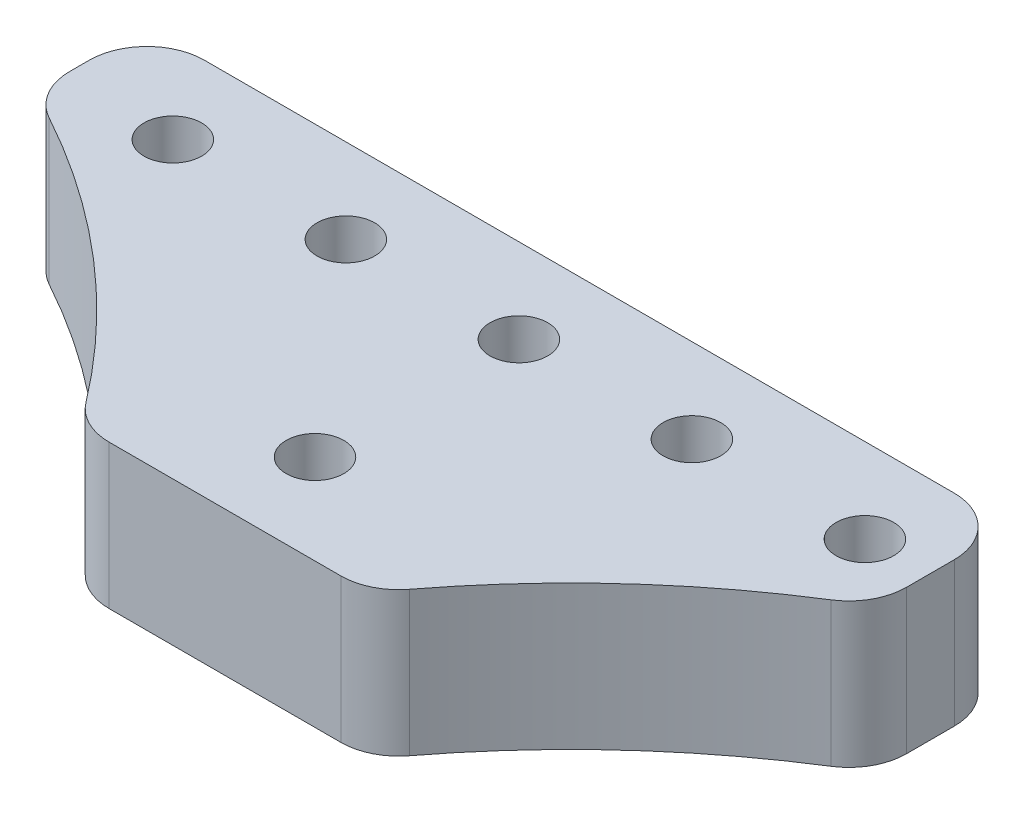
ISO-10303-21;
HEADER;
FILE_DESCRIPTION(('STEP AP214'),'2;1');
FILE_NAME('part.step','',(''),(''),'','','');
FILE_SCHEMA(('AUTOMOTIVE_DESIGN { 1 0 10303 214 1 1 1 1 }'));
ENDSEC;
DATA;
#1=APPLICATION_CONTEXT('core data for automotive mechanical design processes');
#2=APPLICATION_PROTOCOL_DEFINITION('international standard','automotive_design',2000,#1);
#3=PRODUCT_CONTEXT('',#1,'mechanical');
#4=PRODUCT('Part','Part','',(#3));
#5=PRODUCT_RELATED_PRODUCT_CATEGORY('part','',(#4));
#6=PRODUCT_DEFINITION_FORMATION('','',#4);
#7=PRODUCT_DEFINITION_CONTEXT('part definition',#1,'design');
#8=PRODUCT_DEFINITION('design','',#6,#7);
#9=PRODUCT_DEFINITION_SHAPE('','',#8);
#10=(LENGTH_UNIT() NAMED_UNIT(*) SI_UNIT(.MILLI.,.METRE.));
#11=(NAMED_UNIT(*) PLANE_ANGLE_UNIT() SI_UNIT($,.RADIAN.));
#12=(NAMED_UNIT(*) SI_UNIT($,.STERADIAN.) SOLID_ANGLE_UNIT());
#13=UNCERTAINTY_MEASURE_WITH_UNIT(LENGTH_MEASURE(1.E-05),#10,'distance_accuracy_value','');
#14=(GEOMETRIC_REPRESENTATION_CONTEXT(3) GLOBAL_UNCERTAINTY_ASSIGNED_CONTEXT((#13)) GLOBAL_UNIT_ASSIGNED_CONTEXT((#10,
#11,#12)) REPRESENTATION_CONTEXT('',''));
#15=CARTESIAN_POINT('',(0.,0.,0.));
#16=DIRECTION('',(0.,0.,1.));
#17=DIRECTION('',(1.,0.,0.));
#18=AXIS2_PLACEMENT_3D('',#15,#16,#17);
#19=CARTESIAN_POINT('',(0.,6.35,16.6652345173048));
#20=DIRECTION('',(0.,0.,-1.));
#21=DIRECTION('',(-1.,0.,0.));
#22=AXIS2_PLACEMENT_3D('',#19,#20,#21);
#23=PLANE('',#22);
#24=DIRECTION('',(1.,0.,0.));
#25=VECTOR('',#24,1.);
#26=CARTESIAN_POINT('',(0.,6.35,16.6652345173048));
#27=LINE('',#26,#25);
#28=CARTESIAN_POINT('',(15.0031682788959,6.35,16.6652345173048));
#29=VERTEX_POINT('',#28);
#30=CARTESIAN_POINT('',(25.2093042764426,6.35,16.6652345173048));
#31=VERTEX_POINT('',#30);
#32=EDGE_CURVE('E144',#29,#31,#27,.T.);
#33=ORIENTED_EDGE('',*,*,#32,.F.);
#34=DIRECTION('',(0.,1.,0.));
#35=VECTOR('',#34,1.);
#36=CARTESIAN_POINT('',(15.0031682788959,0.,16.6652345173048));
#37=LINE('',#36,#35);
#38=CARTESIAN_POINT('',(15.0031682788959,0.,16.6652345173048));
#39=VERTEX_POINT('',#38);
#40=EDGE_CURVE('E129',#29,#39,#37,.F.);
#41=ORIENTED_EDGE('',*,*,#40,.T.);
#42=DIRECTION('',(1.,0.,0.));
#43=VECTOR('',#42,1.);
#44=CARTESIAN_POINT('',(0.,0.,16.6652345173048));
#45=LINE('',#44,#43);
#46=CARTESIAN_POINT('',(25.2093042764426,0.,16.6652345173048));
#47=VERTEX_POINT('',#46);
#48=EDGE_CURVE('E141',#39,#47,#45,.T.);
#49=ORIENTED_EDGE('',*,*,#48,.T.);
#50=DIRECTION('',(0.,-1.,0.));
#51=VECTOR('',#50,1.);
#52=CARTESIAN_POINT('',(25.2093042764426,6.35,16.6652345173048));
#53=LINE('',#52,#51);
#54=EDGE_CURVE('E146',#47,#31,#53,.F.);
#55=ORIENTED_EDGE('',*,*,#54,.T.);
#56=EDGE_LOOP('',(#33,#41,#49,#55));
#57=FACE_BOUND('',#56,.T.);
#58=ADVANCED_FACE('F35',(#57),#23,.F.);
#59=CARTESIAN_POINT('',(56.6434499742083,6.35,38.0237975278566));
#60=DIRECTION('',(0.,-1.,0.));
#61=DIRECTION('',(0.,0.,-1.));
#62=AXIS2_PLACEMENT_3D('',#59,#60,#61);
#63=CYLINDRICAL_SURFACE('',#62,36.9472996002218);
#64=CARTESIAN_POINT('',(56.6434499742083,6.35,38.0237975278566));
#65=DIRECTION('',(0.,1.,0.));
#66=DIRECTION('',(0.,0.,1.));
#67=AXIS2_PLACEMENT_3D('',#64,#65,#66);
#68=CIRCLE('',#67,36.9472996002218);
#69=CARTESIAN_POINT('',(27.2312893420376,6.35,15.6624971476028));
#70=VERTEX_POINT('',#69);
#71=CARTESIAN_POINT('',(36.9161819490485,6.35,6.78379362241421));
#72=VERTEX_POINT('',#71);
#73=EDGE_CURVE('E337',#70,#72,#68,.F.);
#74=ORIENTED_EDGE('',*,*,#73,.F.);
#75=DIRECTION('',(0.,-1.,0.));
#76=VECTOR('',#75,1.);
#77=CARTESIAN_POINT('',(27.2312893420376,6.35,15.6624971476028));
#78=LINE('',#77,#76);
#79=CARTESIAN_POINT('',(27.2312893420376,0.,15.6624971476028));
#80=VERTEX_POINT('',#79);
#81=EDGE_CURVE('E212',#70,#80,#78,.T.);
#82=ORIENTED_EDGE('',*,*,#81,.T.);
#83=CARTESIAN_POINT('',(56.6434499742083,0.,38.0237975278566));
#84=DIRECTION('',(0.,1.,0.));
#85=DIRECTION('',(0.,0.,1.));
#86=AXIS2_PLACEMENT_3D('',#83,#84,#85);
#87=CIRCLE('',#86,36.9472996002218);
#88=CARTESIAN_POINT('',(36.9161819490485,0.,6.78379362241421));
#89=VERTEX_POINT('',#88);
#90=EDGE_CURVE('E151',#80,#89,#87,.F.);
#91=ORIENTED_EDGE('',*,*,#90,.T.);
#92=DIRECTION('',(0.,-1.,0.));
#93=VECTOR('',#92,1.);
#94=CARTESIAN_POINT('',(36.9161819490485,6.35,6.78379362241421));
#95=LINE('',#94,#93);
#96=EDGE_CURVE('E210',#89,#72,#95,.F.);
#97=ORIENTED_EDGE('',*,*,#96,.T.);
#98=EDGE_LOOP('',(#74,#82,#91,#97));
#99=FACE_BOUND('',#98,.T.);
#100=ADVANCED_FACE('F283',(#99),#63,.F.);
#101=CARTESIAN_POINT('',(38.1,6.35,0.));
#102=DIRECTION('',(1.,0.,0.));
#103=DIRECTION('',(0.,0.,-1.));
#104=AXIS2_PLACEMENT_3D('',#101,#102,#103);
#105=PLANE('',#104);
#106=DIRECTION('',(0.,0.,1.));
#107=VECTOR('',#106,1.);
#108=CARTESIAN_POINT('',(38.1,6.35,0.));
#109=LINE('',#108,#107);
#110=CARTESIAN_POINT('',(38.1,6.35,2.54));
#111=VERTEX_POINT('',#110);
#112=CARTESIAN_POINT('',(38.1,6.35,4.63615060713556));
#113=VERTEX_POINT('',#112);
#114=EDGE_CURVE('E246',#111,#113,#109,.T.);
#115=ORIENTED_EDGE('',*,*,#114,.T.);
#116=DIRECTION('',(0.,1.,0.));
#117=VECTOR('',#116,1.);
#118=CARTESIAN_POINT('',(38.1,0.,4.63615060713556));
#119=LINE('',#118,#117);
#120=CARTESIAN_POINT('',(38.1,0.,4.63615060713556));
#121=VERTEX_POINT('',#120);
#122=EDGE_CURVE('E217',#113,#121,#119,.F.);
#123=ORIENTED_EDGE('',*,*,#122,.T.);
#124=DIRECTION('',(0.,0.,1.));
#125=VECTOR('',#124,1.);
#126=CARTESIAN_POINT('',(38.1,0.,0.));
#127=LINE('',#126,#125);
#128=CARTESIAN_POINT('',(38.1,0.,2.54));
#129=VERTEX_POINT('',#128);
#130=EDGE_CURVE('E154',#129,#121,#127,.T.);
#131=ORIENTED_EDGE('',*,*,#130,.F.);
#132=DIRECTION('',(0.,-1.,0.));
#133=VECTOR('',#132,1.);
#134=CARTESIAN_POINT('',(38.1,6.35,2.54));
#135=LINE('',#134,#133);
#136=EDGE_CURVE('E215',#129,#111,#135,.F.);
#137=ORIENTED_EDGE('',*,*,#136,.T.);
#138=EDGE_LOOP('',(#115,#123,#131,#137));
#139=FACE_BOUND('',#138,.T.);
#140=ADVANCED_FACE('F288',(#139),#105,.T.);
#141=CARTESIAN_POINT('',(0.,6.35,0.));
#142=DIRECTION('',(0.,0.,-1.));
#143=DIRECTION('',(-1.,0.,0.));
#144=AXIS2_PLACEMENT_3D('',#141,#142,#143);
#145=PLANE('',#144);
#146=DIRECTION('',(1.,0.,0.));
#147=VECTOR('',#146,1.);
#148=CARTESIAN_POINT('',(0.,6.35,0.));
#149=LINE('',#148,#147);
#150=CARTESIAN_POINT('',(2.54,6.35,0.));
#151=VERTEX_POINT('',#150);
#152=CARTESIAN_POINT('',(35.56,6.35,0.));
#153=VERTEX_POINT('',#152);
#154=EDGE_CURVE('E230',#151,#153,#149,.T.);
#155=ORIENTED_EDGE('',*,*,#154,.T.);
#156=DIRECTION('',(0.,-1.,0.));
#157=VECTOR('',#156,1.);
#158=CARTESIAN_POINT('',(35.56,6.35,0.));
#159=LINE('',#158,#157);
#160=CARTESIAN_POINT('',(35.56,0.,0.));
#161=VERTEX_POINT('',#160);
#162=EDGE_CURVE('E222',#153,#161,#159,.T.);
#163=ORIENTED_EDGE('',*,*,#162,.T.);
#164=DIRECTION('',(1.,0.,0.));
#165=VECTOR('',#164,1.);
#166=CARTESIAN_POINT('',(0.,0.,0.));
#167=LINE('',#166,#165);
#168=CARTESIAN_POINT('',(2.54,0.,0.));
#169=VERTEX_POINT('',#168);
#170=EDGE_CURVE('E162',#169,#161,#167,.T.);
#171=ORIENTED_EDGE('',*,*,#170,.F.);
#172=DIRECTION('',(0.,-1.,0.));
#173=VECTOR('',#172,1.);
#174=CARTESIAN_POINT('',(2.54,6.35,0.));
#175=LINE('',#174,#173);
#176=EDGE_CURVE('E220',#169,#151,#175,.F.);
#177=ORIENTED_EDGE('',*,*,#176,.T.);
#178=EDGE_LOOP('',(#155,#163,#171,#177));
#179=FACE_BOUND('',#178,.T.);
#180=ADVANCED_FACE('F228',(#179),#145,.T.);
#181=CARTESIAN_POINT('',(0.,6.35,0.));
#182=DIRECTION('',(1.,0.,0.));
#183=DIRECTION('',(0.,0.,-1.));
#184=AXIS2_PLACEMENT_3D('',#181,#182,#183);
#185=PLANE('',#184);
#186=DIRECTION('',(0.,0.,1.));
#187=VECTOR('',#186,1.);
#188=CARTESIAN_POINT('',(0.,6.35,0.));
#189=LINE('',#188,#187);
#190=CARTESIAN_POINT('',(0.,6.35,2.54));
#191=VERTEX_POINT('',#190);
#192=CARTESIAN_POINT('',(0.,6.35,3.39218125759846));
#193=VERTEX_POINT('',#192);
#194=EDGE_CURVE('E239',#191,#193,#189,.T.);
#195=ORIENTED_EDGE('',*,*,#194,.F.);
#196=DIRECTION('',(0.,-1.,0.));
#197=VECTOR('',#196,1.);
#198=CARTESIAN_POINT('',(0.,0.,2.54));
#199=LINE('',#198,#197);
#200=CARTESIAN_POINT('',(0.,0.,2.54));
#201=VERTEX_POINT('',#200);
#202=EDGE_CURVE('E11',#191,#201,#199,.T.);
#203=ORIENTED_EDGE('',*,*,#202,.T.);
#204=DIRECTION('',(0.,0.,1.));
#205=VECTOR('',#204,1.);
#206=CARTESIAN_POINT('',(0.,0.,0.));
#207=LINE('',#206,#205);
#208=CARTESIAN_POINT('',(0.,0.,3.39218125759846));
#209=VERTEX_POINT('',#208);
#210=EDGE_CURVE('E165',#201,#209,#207,.T.);
#211=ORIENTED_EDGE('',*,*,#210,.T.);
#212=DIRECTION('',(0.,1.,0.));
#213=VECTOR('',#212,1.);
#214=CARTESIAN_POINT('',(0.,6.35,3.39218125759846));
#215=LINE('',#214,#213);
#216=EDGE_CURVE('E43',#209,#193,#215,.T.);
#217=ORIENTED_EDGE('',*,*,#216,.T.);
#218=EDGE_LOOP('',(#195,#203,#211,#217));
#219=FACE_BOUND('',#218,.T.);
#220=ADVANCED_FACE('F238',(#219),#185,.F.);
#221=CARTESIAN_POINT('',(4.86623627766924,6.35,3.72093701956544));
#222=DIRECTION('',(0.,-1.,0.));
#223=DIRECTION('',(0.,0.,-1.));
#224=AXIS2_PLACEMENT_3D('',#221,#222,#223);
#225=CYLINDRICAL_SURFACE('',#224,1.27);
#226=CARTESIAN_POINT('',(4.86623627766924,6.35,3.72093701956544));
#227=DIRECTION('',(0.,1.,0.));
#228=DIRECTION('',(0.,0.,1.));
#229=AXIS2_PLACEMENT_3D('',#226,#227,#228);
#230=CIRCLE('',#229,1.27);
#231=CARTESIAN_POINT('',(4.86623627766924,6.35,4.99093701956544));
#232=VERTEX_POINT('',#231);
#233=EDGE_CURVE('E260',#232,#232,#230,.T.);
#234=ORIENTED_EDGE('',*,*,#233,.T.);
#235=EDGE_LOOP('',(#234));
#236=FACE_BOUND('',#235,.T.);
#237=CARTESIAN_POINT('',(4.86623627766924,0.,3.72093701956544));
#238=DIRECTION('',(0.,1.,0.));
#239=DIRECTION('',(0.,0.,1.));
#240=AXIS2_PLACEMENT_3D('',#237,#238,#239);
#241=CIRCLE('',#240,1.27);
#242=CARTESIAN_POINT('',(4.86623627766924,0.,4.99093701956544));
#243=VERTEX_POINT('',#242);
#244=EDGE_CURVE('E181',#243,#243,#241,.T.);
#245=ORIENTED_EDGE('',*,*,#244,.F.);
#246=EDGE_LOOP('',(#245));
#247=FACE_BOUND('',#246,.T.);
#248=ADVANCED_FACE('F327',(#236,#247),#225,.F.);
#249=CARTESIAN_POINT('',(12.4862362776692,6.35,3.72093701956544));
#250=DIRECTION('',(0.,-1.,0.));
#251=DIRECTION('',(0.,0.,-1.));
#252=AXIS2_PLACEMENT_3D('',#249,#250,#251);
#253=CYLINDRICAL_SURFACE('',#252,1.27);
#254=CARTESIAN_POINT('',(12.4862362776692,6.35,3.72093701956544));
#255=DIRECTION('',(0.,1.,0.));
#256=DIRECTION('',(0.,0.,1.));
#257=AXIS2_PLACEMENT_3D('',#254,#255,#256);
#258=CIRCLE('',#257,1.27);
#259=CARTESIAN_POINT('',(12.4862362776692,6.35,4.99093701956544));
#260=VERTEX_POINT('',#259);
#261=EDGE_CURVE('E258',#260,#260,#258,.T.);
#262=ORIENTED_EDGE('',*,*,#261,.T.);
#263=EDGE_LOOP('',(#262));
#264=FACE_BOUND('',#263,.T.);
#265=CARTESIAN_POINT('',(12.4862362776692,0.,3.72093701956544));
#266=DIRECTION('',(0.,1.,0.));
#267=DIRECTION('',(0.,0.,1.));
#268=AXIS2_PLACEMENT_3D('',#265,#266,#267);
#269=CIRCLE('',#268,1.27);
#270=CARTESIAN_POINT('',(12.4862362776692,0.,4.99093701956544));
#271=VERTEX_POINT('',#270);
#272=EDGE_CURVE('E178',#271,#271,#269,.T.);
#273=ORIENTED_EDGE('',*,*,#272,.F.);
#274=EDGE_LOOP('',(#273));
#275=FACE_BOUND('',#274,.T.);
#276=ADVANCED_FACE('F362',(#264,#275),#253,.F.);
#277=CARTESIAN_POINT('',(27.7262362776692,6.35,3.72093701956544));
#278=DIRECTION('',(0.,-1.,0.));
#279=DIRECTION('',(0.,0.,-1.));
#280=AXIS2_PLACEMENT_3D('',#277,#278,#279);
#281=CYLINDRICAL_SURFACE('',#280,1.27);
#282=CARTESIAN_POINT('',(27.7262362776692,6.35,3.72093701956544));
#283=DIRECTION('',(0.,1.,0.));
#284=DIRECTION('',(0.,0.,1.));
#285=AXIS2_PLACEMENT_3D('',#282,#283,#284);
#286=CIRCLE('',#285,1.27);
#287=CARTESIAN_POINT('',(27.7262362776692,6.35,4.99093701956544));
#288=VERTEX_POINT('',#287);
#289=EDGE_CURVE('E255',#288,#288,#286,.T.);
#290=ORIENTED_EDGE('',*,*,#289,.T.);
#291=EDGE_LOOP('',(#290));
#292=FACE_BOUND('',#291,.T.);
#293=CARTESIAN_POINT('',(27.7262362776692,0.,3.72093701956544));
#294=DIRECTION('',(0.,1.,0.));
#295=DIRECTION('',(0.,0.,1.));
#296=AXIS2_PLACEMENT_3D('',#293,#294,#295);
#297=CIRCLE('',#296,1.27);
#298=CARTESIAN_POINT('',(27.7262362776692,0.,4.99093701956544));
#299=VERTEX_POINT('',#298);
#300=EDGE_CURVE('E175',#299,#299,#297,.T.);
#301=ORIENTED_EDGE('',*,*,#300,.F.);
#302=EDGE_LOOP('',(#301));
#303=FACE_BOUND('',#302,.T.);
#304=ADVANCED_FACE('F369',(#292,#303),#281,.F.);
#305=CARTESIAN_POINT('',(35.3462362776692,6.35,3.72093701956544));
#306=DIRECTION('',(0.,-1.,0.));
#307=DIRECTION('',(0.,0.,-1.));
#308=AXIS2_PLACEMENT_3D('',#305,#306,#307);
#309=CYLINDRICAL_SURFACE('',#308,1.27000000000001);
#310=CARTESIAN_POINT('',(35.3462362776692,6.35,3.72093701956544));
#311=DIRECTION('',(0.,1.,0.));
#312=DIRECTION('',(0.,0.,1.));
#313=AXIS2_PLACEMENT_3D('',#310,#311,#312);
#314=CIRCLE('',#313,1.27000000000001);
#315=CARTESIAN_POINT('',(35.3462362776692,6.35,4.99093701956545));
#316=VERTEX_POINT('',#315);
#317=EDGE_CURVE('E252',#316,#316,#314,.T.);
#318=ORIENTED_EDGE('',*,*,#317,.T.);
#319=EDGE_LOOP('',(#318));
#320=FACE_BOUND('',#319,.T.);
#321=CARTESIAN_POINT('',(35.3462362776692,0.,3.72093701956544));
#322=DIRECTION('',(0.,1.,0.));
#323=DIRECTION('',(0.,0.,1.));
#324=AXIS2_PLACEMENT_3D('',#321,#322,#323);
#325=CIRCLE('',#324,1.27000000000001);
#326=CARTESIAN_POINT('',(35.3462362776692,0.,4.99093701956545));
#327=VERTEX_POINT('',#326);
#328=EDGE_CURVE('E172',#327,#327,#325,.T.);
#329=ORIENTED_EDGE('',*,*,#328,.F.);
#330=EDGE_LOOP('',(#329));
#331=FACE_BOUND('',#330,.T.);
#332=ADVANCED_FACE('F320',(#320,#331),#309,.F.);
#333=CARTESIAN_POINT('',(20.1062362776692,6.35,12.7));
#334=DIRECTION('',(0.,-1.,0.));
#335=DIRECTION('',(0.,0.,-1.));
#336=AXIS2_PLACEMENT_3D('',#333,#334,#335);
#337=CYLINDRICAL_SURFACE('',#336,1.27);
#338=CARTESIAN_POINT('',(20.1062362776692,6.35,12.7));
#339=DIRECTION('',(0.,1.,0.));
#340=DIRECTION('',(0.,0.,1.));
#341=AXIS2_PLACEMENT_3D('',#338,#339,#340);
#342=CIRCLE('',#341,1.27);
#343=CARTESIAN_POINT('',(20.1062362776692,6.35,13.97));
#344=VERTEX_POINT('',#343);
#345=EDGE_CURVE('E244',#344,#344,#342,.T.);
#346=ORIENTED_EDGE('',*,*,#345,.T.);
#347=EDGE_LOOP('',(#346));
#348=FACE_BOUND('',#347,.T.);
#349=CARTESIAN_POINT('',(20.1062362776692,0.,12.7));
#350=DIRECTION('',(0.,1.,0.));
#351=DIRECTION('',(0.,0.,1.));
#352=AXIS2_PLACEMENT_3D('',#349,#350,#351);
#353=CIRCLE('',#352,1.27);
#354=CARTESIAN_POINT('',(20.1062362776692,0.,13.97));
#355=VERTEX_POINT('',#354);
#356=EDGE_CURVE('E169',#355,#355,#353,.T.);
#357=ORIENTED_EDGE('',*,*,#356,.F.);
#358=EDGE_LOOP('',(#357));
#359=FACE_BOUND('',#358,.T.);
#360=ADVANCED_FACE('F315',(#348,#359),#337,.F.);
#361=CARTESIAN_POINT('',(-16.4309774188698,6.35,38.0237975278566));
#362=DIRECTION('',(0.,-1.,0.));
#363=DIRECTION('',(0.,0.,-1.));
#364=AXIS2_PLACEMENT_3D('',#361,#362,#363);
#365=CYLINDRICAL_SURFACE('',#364,36.9472996002218);
#366=CARTESIAN_POINT('',(-16.4309774188698,0.,38.0237975278566));
#367=DIRECTION('',(0.,1.,0.));
#368=DIRECTION('',(0.,0.,1.));
#369=AXIS2_PLACEMENT_3D('',#366,#367,#368);
#370=CIRCLE('',#369,36.9472996002218);
#371=CARTESIAN_POINT('',(12.9811832133009,0.,15.6624971476028));
#372=VERTEX_POINT('',#371);
#373=CARTESIAN_POINT('',(1.31970174887171,0.,5.61984195400023));
#374=VERTEX_POINT('',#373);
#375=EDGE_CURVE('E167',#372,#374,#370,.T.);
#376=ORIENTED_EDGE('',*,*,#375,.F.);
#377=DIRECTION('',(0.,-1.,0.));
#378=VECTOR('',#377,1.);
#379=CARTESIAN_POINT('',(12.9811832133009,6.35,15.6624971476028));
#380=LINE('',#379,#378);
#381=CARTESIAN_POINT('',(12.9811832133009,6.35,15.6624971476028));
#382=VERTEX_POINT('',#381);
#383=EDGE_CURVE('E130',#372,#382,#380,.F.);
#384=ORIENTED_EDGE('',*,*,#383,.T.);
#385=CARTESIAN_POINT('',(-16.4309774188698,6.35,38.0237975278566));
#386=DIRECTION('',(0.,1.,0.));
#387=DIRECTION('',(0.,0.,1.));
#388=AXIS2_PLACEMENT_3D('',#385,#386,#387);
#389=CIRCLE('',#388,36.9472996002218);
#390=CARTESIAN_POINT('',(1.31970174887171,6.35,5.61984195400023));
#391=VERTEX_POINT('',#390);
#392=EDGE_CURVE('E241',#382,#391,#389,.T.);
#393=ORIENTED_EDGE('',*,*,#392,.T.);
#394=DIRECTION('',(0.,-1.,0.));
#395=VECTOR('',#394,1.);
#396=CARTESIAN_POINT('',(1.31970174887171,6.35,5.61984195400023));
#397=LINE('',#396,#395);
#398=EDGE_CURVE('E135',#391,#374,#397,.T.);
#399=ORIENTED_EDGE('',*,*,#398,.T.);
#400=EDGE_LOOP('',(#376,#384,#393,#399));
#401=FACE_BOUND('',#400,.T.);
#402=ADVANCED_FACE('F278',(#401),#365,.F.);
#403=CARTESIAN_POINT('',(20.1062362776692,6.35,3.72093701956544));
#404=DIRECTION('',(0.,-1.,0.));
#405=DIRECTION('',(0.,0.,-1.));
#406=AXIS2_PLACEMENT_3D('',#403,#404,#405);
#407=CYLINDRICAL_SURFACE('',#406,1.27);
#408=CARTESIAN_POINT('',(20.1062362776692,6.35,3.72093701956544));
#409=DIRECTION('',(0.,1.,0.));
#410=DIRECTION('',(0.,0.,1.));
#411=AXIS2_PLACEMENT_3D('',#408,#409,#410);
#412=CIRCLE('',#411,1.27);
#413=CARTESIAN_POINT('',(20.1062362776692,6.35,4.99093701956544));
#414=VERTEX_POINT('',#413);
#415=EDGE_CURVE('E157',#414,#414,#412,.T.);
#416=ORIENTED_EDGE('',*,*,#415,.T.);
#417=EDGE_LOOP('',(#416));
#418=FACE_BOUND('',#417,.T.);
#419=CARTESIAN_POINT('',(20.1062362776692,0.,3.72093701956544));
#420=DIRECTION('',(0.,1.,0.));
#421=DIRECTION('',(0.,0.,1.));
#422=AXIS2_PLACEMENT_3D('',#419,#420,#421);
#423=CIRCLE('',#422,1.27);
#424=CARTESIAN_POINT('',(20.1062362776692,0.,4.99093701956544));
#425=VERTEX_POINT('',#424);
#426=EDGE_CURVE('E184',#425,#425,#423,.T.);
#427=ORIENTED_EDGE('',*,*,#426,.F.);
#428=EDGE_LOOP('',(#427));
#429=FACE_BOUND('',#428,.T.);
#430=ADVANCED_FACE('F267',(#418,#429),#407,.F.);
#431=CARTESIAN_POINT('',(0.,6.35,0.));
#432=DIRECTION('',(0.,1.,0.));
#433=DIRECTION('',(0.,0.,1.));
#434=AXIS2_PLACEMENT_3D('',#431,#432,#433);
#435=PLANE('',#434);
#436=ORIENTED_EDGE('',*,*,#392,.F.);
#437=CARTESIAN_POINT('',(15.0031682788959,6.35,14.1252345173048));
#438=DIRECTION('',(0.,1.,0.));
#439=DIRECTION('',(0.,0.,1.));
#440=AXIS2_PLACEMENT_3D('',#437,#438,#439);
#441=CIRCLE('',#440,2.54);
#442=EDGE_CURVE('E208',#382,#29,#441,.T.);
#443=ORIENTED_EDGE('',*,*,#442,.T.);
#444=ORIENTED_EDGE('',*,*,#32,.T.);
#445=CARTESIAN_POINT('',(25.2093042764426,6.35,14.1252345173048));
#446=DIRECTION('',(0.,1.,0.));
#447=DIRECTION('',(0.,0.,1.));
#448=AXIS2_PLACEMENT_3D('',#445,#446,#447);
#449=CIRCLE('',#448,2.54);
#450=EDGE_CURVE('E206',#31,#70,#449,.T.);
#451=ORIENTED_EDGE('',*,*,#450,.T.);
#452=ORIENTED_EDGE('',*,*,#73,.T.);
#453=CARTESIAN_POINT('',(35.56,6.35,4.63615060713556));
#454=DIRECTION('',(0.,1.,0.));
#455=DIRECTION('',(0.,0.,1.));
#456=AXIS2_PLACEMENT_3D('',#453,#454,#455);
#457=CIRCLE('',#456,2.54);
#458=EDGE_CURVE('E204',#72,#113,#457,.T.);
#459=ORIENTED_EDGE('',*,*,#458,.T.);
#460=ORIENTED_EDGE('',*,*,#114,.F.);
#461=CARTESIAN_POINT('',(35.56,6.35,2.54));
#462=DIRECTION('',(0.,1.,0.));
#463=DIRECTION('',(0.,0.,1.));
#464=AXIS2_PLACEMENT_3D('',#461,#462,#463);
#465=CIRCLE('',#464,2.54);
#466=EDGE_CURVE('E202',#111,#153,#465,.T.);
#467=ORIENTED_EDGE('',*,*,#466,.T.);
#468=ORIENTED_EDGE('',*,*,#154,.F.);
#469=CARTESIAN_POINT('',(2.54,6.35,2.54));
#470=DIRECTION('',(0.,1.,0.));
#471=DIRECTION('',(0.,0.,1.));
#472=AXIS2_PLACEMENT_3D('',#469,#470,#471);
#473=CIRCLE('',#472,2.54);
#474=EDGE_CURVE('E56',#151,#191,#473,.T.);
#475=ORIENTED_EDGE('',*,*,#474,.T.);
#476=ORIENTED_EDGE('',*,*,#194,.T.);
#477=CARTESIAN_POINT('',(2.54,6.35,3.39218125759846));
#478=DIRECTION('',(0.,1.,0.));
#479=DIRECTION('',(0.,0.,1.));
#480=AXIS2_PLACEMENT_3D('',#477,#478,#479);
#481=CIRCLE('',#480,2.54);
#482=EDGE_CURVE('E199',#193,#391,#481,.T.);
#483=ORIENTED_EDGE('',*,*,#482,.T.);
#484=EDGE_LOOP('',(#436,#443,#444,#451,#452,#459,#460,#467,#468,#475,#476,#483));
#485=FACE_BOUND('',#484,.T.);
#486=ORIENTED_EDGE('',*,*,#345,.F.);
#487=EDGE_LOOP('',(#486));
#488=FACE_BOUND('',#487,.T.);
#489=ORIENTED_EDGE('',*,*,#317,.F.);
#490=EDGE_LOOP('',(#489));
#491=FACE_BOUND('',#490,.T.);
#492=ORIENTED_EDGE('',*,*,#289,.F.);
#493=EDGE_LOOP('',(#492));
#494=FACE_BOUND('',#493,.T.);
#495=ORIENTED_EDGE('',*,*,#261,.F.);
#496=EDGE_LOOP('',(#495));
#497=FACE_BOUND('',#496,.T.);
#498=ORIENTED_EDGE('',*,*,#233,.F.);
#499=EDGE_LOOP('',(#498));
#500=FACE_BOUND('',#499,.T.);
#501=ORIENTED_EDGE('',*,*,#415,.F.);
#502=EDGE_LOOP('',(#501));
#503=FACE_BOUND('',#502,.T.);
#504=ADVANCED_FACE('F270',(#485,#488,#491,#494,#497,#500,#503),#435,.T.);
#505=CARTESIAN_POINT('',(0.,0.,0.));
#506=DIRECTION('',(0.,1.,0.));
#507=DIRECTION('',(0.,0.,1.));
#508=AXIS2_PLACEMENT_3D('',#505,#506,#507);
#509=PLANE('',#508);
#510=ORIENTED_EDGE('',*,*,#48,.F.);
#511=CARTESIAN_POINT('',(15.0031682788959,0.,14.1252345173048));
#512=DIRECTION('',(0.,1.,0.));
#513=DIRECTION('',(0.,0.,1.));
#514=AXIS2_PLACEMENT_3D('',#511,#512,#513);
#515=CIRCLE('',#514,2.54);
#516=EDGE_CURVE('E125',#39,#372,#515,.F.);
#517=ORIENTED_EDGE('',*,*,#516,.T.);
#518=ORIENTED_EDGE('',*,*,#375,.T.);
#519=CARTESIAN_POINT('',(2.54,0.,3.39218125759846));
#520=DIRECTION('',(0.,1.,0.));
#521=DIRECTION('',(0.,0.,1.));
#522=AXIS2_PLACEMENT_3D('',#519,#520,#521);
#523=CIRCLE('',#522,2.54);
#524=EDGE_CURVE('E145',#374,#209,#523,.F.);
#525=ORIENTED_EDGE('',*,*,#524,.T.);
#526=ORIENTED_EDGE('',*,*,#210,.F.);
#527=CARTESIAN_POINT('',(2.54,0.,2.54));
#528=DIRECTION('',(0.,1.,0.));
#529=DIRECTION('',(0.,0.,1.));
#530=AXIS2_PLACEMENT_3D('',#527,#528,#529);
#531=CIRCLE('',#530,2.54);
#532=EDGE_CURVE('E189',#201,#169,#531,.F.);
#533=ORIENTED_EDGE('',*,*,#532,.T.);
#534=ORIENTED_EDGE('',*,*,#170,.T.);
#535=CARTESIAN_POINT('',(35.56,0.,2.54));
#536=DIRECTION('',(0.,1.,0.));
#537=DIRECTION('',(0.,0.,1.));
#538=AXIS2_PLACEMENT_3D('',#535,#536,#537);
#539=CIRCLE('',#538,2.54);
#540=EDGE_CURVE('E191',#161,#129,#539,.F.);
#541=ORIENTED_EDGE('',*,*,#540,.T.);
#542=ORIENTED_EDGE('',*,*,#130,.T.);
#543=CARTESIAN_POINT('',(35.56,0.,4.63615060713556));
#544=DIRECTION('',(0.,1.,0.));
#545=DIRECTION('',(0.,0.,1.));
#546=AXIS2_PLACEMENT_3D('',#543,#544,#545);
#547=CIRCLE('',#546,2.54);
#548=EDGE_CURVE('E193',#121,#89,#547,.F.);
#549=ORIENTED_EDGE('',*,*,#548,.T.);
#550=ORIENTED_EDGE('',*,*,#90,.F.);
#551=CARTESIAN_POINT('',(25.2093042764426,0.,14.1252345173048));
#552=DIRECTION('',(0.,1.,0.));
#553=DIRECTION('',(0.,0.,1.));
#554=AXIS2_PLACEMENT_3D('',#551,#552,#553);
#555=CIRCLE('',#554,2.54);
#556=EDGE_CURVE('E136',#80,#47,#555,.F.);
#557=ORIENTED_EDGE('',*,*,#556,.T.);
#558=EDGE_LOOP('',(#510,#517,#518,#525,#526,#533,#534,#541,#542,#549,#550,#557));
#559=FACE_BOUND('',#558,.T.);
#560=ORIENTED_EDGE('',*,*,#356,.T.);
#561=EDGE_LOOP('',(#560));
#562=FACE_BOUND('',#561,.T.);
#563=ORIENTED_EDGE('',*,*,#328,.T.);
#564=EDGE_LOOP('',(#563));
#565=FACE_BOUND('',#564,.T.);
#566=ORIENTED_EDGE('',*,*,#300,.T.);
#567=EDGE_LOOP('',(#566));
#568=FACE_BOUND('',#567,.T.);
#569=ORIENTED_EDGE('',*,*,#272,.T.);
#570=EDGE_LOOP('',(#569));
#571=FACE_BOUND('',#570,.T.);
#572=ORIENTED_EDGE('',*,*,#244,.T.);
#573=EDGE_LOOP('',(#572));
#574=FACE_BOUND('',#573,.T.);
#575=ORIENTED_EDGE('',*,*,#426,.T.);
#576=EDGE_LOOP('',(#575));
#577=FACE_BOUND('',#576,.T.);
#578=ADVANCED_FACE('F148',(#559,#562,#565,#568,#571,#574,#577),#509,.F.);
#579=CARTESIAN_POINT('',(15.0031682788959,6.35,14.1252345173048));
#580=DIRECTION('',(0.,-1.,0.));
#581=DIRECTION('',(0.,0.,-1.));
#582=AXIS2_PLACEMENT_3D('',#579,#580,#581);
#583=CYLINDRICAL_SURFACE('',#582,2.54);
#584=ORIENTED_EDGE('',*,*,#442,.F.);
#585=ORIENTED_EDGE('',*,*,#383,.F.);
#586=ORIENTED_EDGE('',*,*,#516,.F.);
#587=ORIENTED_EDGE('',*,*,#40,.F.);
#588=EDGE_LOOP('',(#584,#585,#586,#587));
#589=FACE_BOUND('',#588,.T.);
#590=ADVANCED_FACE('F128',(#589),#583,.T.);
#591=CARTESIAN_POINT('',(25.2093042764426,6.35,14.1252345173048));
#592=DIRECTION('',(0.,-1.,0.));
#593=DIRECTION('',(0.,0.,-1.));
#594=AXIS2_PLACEMENT_3D('',#591,#592,#593);
#595=CYLINDRICAL_SURFACE('',#594,2.54);
#596=ORIENTED_EDGE('',*,*,#450,.F.);
#597=ORIENTED_EDGE('',*,*,#54,.F.);
#598=ORIENTED_EDGE('',*,*,#556,.F.);
#599=ORIENTED_EDGE('',*,*,#81,.F.);
#600=EDGE_LOOP('',(#596,#597,#598,#599));
#601=FACE_BOUND('',#600,.T.);
#602=ADVANCED_FACE('F295',(#601),#595,.T.);
#603=CARTESIAN_POINT('',(35.56,6.35,4.63615060713556));
#604=DIRECTION('',(0.,-1.,0.));
#605=DIRECTION('',(0.,0.,-1.));
#606=AXIS2_PLACEMENT_3D('',#603,#604,#605);
#607=CYLINDRICAL_SURFACE('',#606,2.54);
#608=ORIENTED_EDGE('',*,*,#458,.F.);
#609=ORIENTED_EDGE('',*,*,#96,.F.);
#610=ORIENTED_EDGE('',*,*,#548,.F.);
#611=ORIENTED_EDGE('',*,*,#122,.F.);
#612=EDGE_LOOP('',(#608,#609,#610,#611));
#613=FACE_BOUND('',#612,.T.);
#614=ADVANCED_FACE('F298',(#613),#607,.T.);
#615=CARTESIAN_POINT('',(35.56,6.35,2.54));
#616=DIRECTION('',(0.,-1.,0.));
#617=DIRECTION('',(0.,0.,-1.));
#618=AXIS2_PLACEMENT_3D('',#615,#616,#617);
#619=CYLINDRICAL_SURFACE('',#618,2.54);
#620=ORIENTED_EDGE('',*,*,#466,.F.);
#621=ORIENTED_EDGE('',*,*,#136,.F.);
#622=ORIENTED_EDGE('',*,*,#540,.F.);
#623=ORIENTED_EDGE('',*,*,#162,.F.);
#624=EDGE_LOOP('',(#620,#621,#622,#623));
#625=FACE_BOUND('',#624,.T.);
#626=ADVANCED_FACE('F302',(#625),#619,.T.);
#627=CARTESIAN_POINT('',(2.54,6.35,2.54));
#628=DIRECTION('',(0.,1.,0.));
#629=DIRECTION('',(0.,0.,1.));
#630=AXIS2_PLACEMENT_3D('',#627,#628,#629);
#631=CYLINDRICAL_SURFACE('',#630,2.54);
#632=ORIENTED_EDGE('',*,*,#474,.F.);
#633=ORIENTED_EDGE('',*,*,#176,.F.);
#634=ORIENTED_EDGE('',*,*,#532,.F.);
#635=ORIENTED_EDGE('',*,*,#202,.F.);
#636=EDGE_LOOP('',(#632,#633,#634,#635));
#637=FACE_BOUND('',#636,.T.);
#638=ADVANCED_FACE('F237',(#637),#631,.T.);
#639=CARTESIAN_POINT('',(2.54,6.35,3.39218125759846));
#640=DIRECTION('',(0.,-1.,0.));
#641=DIRECTION('',(0.,0.,-1.));
#642=AXIS2_PLACEMENT_3D('',#639,#640,#641);
#643=CYLINDRICAL_SURFACE('',#642,2.54);
#644=ORIENTED_EDGE('',*,*,#482,.F.);
#645=ORIENTED_EDGE('',*,*,#216,.F.);
#646=ORIENTED_EDGE('',*,*,#524,.F.);
#647=ORIENTED_EDGE('',*,*,#398,.F.);
#648=EDGE_LOOP('',(#644,#645,#646,#647));
#649=FACE_BOUND('',#648,.T.);
#650=ADVANCED_FACE('F37',(#649),#643,.T.);
#651=CLOSED_SHELL('',(#58,#100,#140,#180,#220,#248,#276,#304,#332,#360,#402,#430,#504,#578,#590,
#602,#614,#626,#638,#650));
#652=MANIFOLD_SOLID_BREP('B2',#651);
#653=ADVANCED_BREP_SHAPE_REPRESENTATION('',(#18,#652),#14);
#654=SHAPE_DEFINITION_REPRESENTATION(#9,#653);
ENDSEC;
END-ISO-10303-21;
